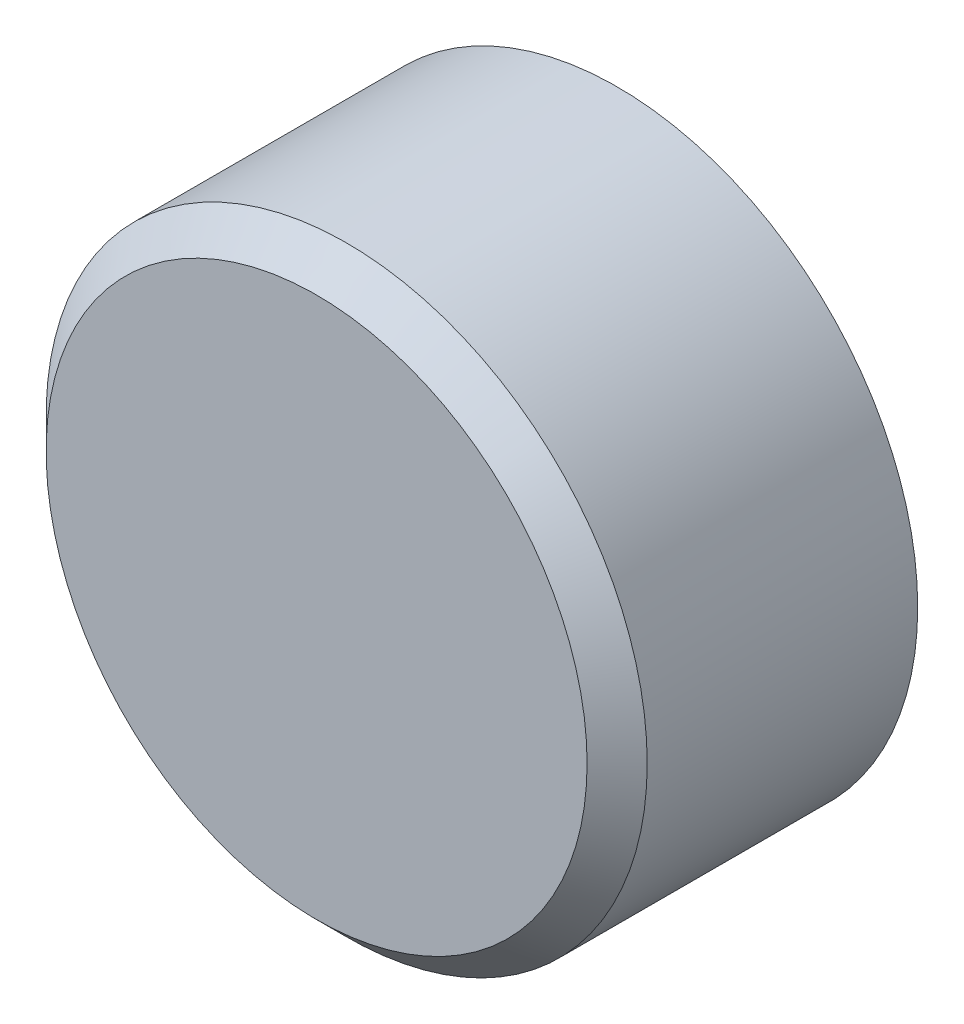
ISO-10303-21;
HEADER;
FILE_DESCRIPTION(('STEP AP214'),'2;1');
FILE_NAME('part.step','',(''),(''),'','','');
FILE_SCHEMA(('AUTOMOTIVE_DESIGN { 1 0 10303 214 1 1 1 1 }'));
ENDSEC;
DATA;
#1=APPLICATION_CONTEXT('core data for automotive mechanical design processes');
#2=APPLICATION_PROTOCOL_DEFINITION('international standard','automotive_design',2000,#1);
#3=PRODUCT_CONTEXT('',#1,'mechanical');
#4=PRODUCT('Part','Part','',(#3));
#5=PRODUCT_RELATED_PRODUCT_CATEGORY('part','',(#4));
#6=PRODUCT_DEFINITION_FORMATION('','',#4);
#7=PRODUCT_DEFINITION_CONTEXT('part definition',#1,'design');
#8=PRODUCT_DEFINITION('design','',#6,#7);
#9=PRODUCT_DEFINITION_SHAPE('','',#8);
#10=(LENGTH_UNIT() NAMED_UNIT(*) SI_UNIT(.MILLI.,.METRE.));
#11=(NAMED_UNIT(*) PLANE_ANGLE_UNIT() SI_UNIT($,.RADIAN.));
#12=(NAMED_UNIT(*) SI_UNIT($,.STERADIAN.) SOLID_ANGLE_UNIT());
#13=UNCERTAINTY_MEASURE_WITH_UNIT(LENGTH_MEASURE(1.E-05),#10,'distance_accuracy_value','');
#14=(GEOMETRIC_REPRESENTATION_CONTEXT(3) GLOBAL_UNCERTAINTY_ASSIGNED_CONTEXT((#13)) GLOBAL_UNIT_ASSIGNED_CONTEXT((#10,
#11,#12)) REPRESENTATION_CONTEXT('',''));
#15=CARTESIAN_POINT('',(0.,0.,0.));
#16=DIRECTION('',(0.,0.,1.));
#17=DIRECTION('',(1.,0.,0.));
#18=AXIS2_PLACEMENT_3D('',#15,#16,#17);
#19=CARTESIAN_POINT('',(0.,0.,20.));
#20=DIRECTION('',(0.,0.,-1.));
#21=DIRECTION('',(-1.,0.,0.));
#22=AXIS2_PLACEMENT_3D('',#19,#20,#21);
#23=CYLINDRICAL_SURFACE('',#22,20.);
#24=CARTESIAN_POINT('',(0.,0.,18.));
#25=DIRECTION('',(0.,0.,1.));
#26=DIRECTION('',(1.,0.,0.));
#27=AXIS2_PLACEMENT_3D('',#24,#25,#26);
#28=CIRCLE('',#27,20.);
#29=CARTESIAN_POINT('',(20.,0.,18.));
#30=VERTEX_POINT('',#29);
#31=EDGE_CURVE('E12',#30,#30,#28,.F.);
#32=ORIENTED_EDGE('',*,*,#31,.T.);
#33=EDGE_LOOP('',(#32));
#34=FACE_BOUND('',#33,.T.);
#35=CARTESIAN_POINT('',(0.,0.,0.));
#36=DIRECTION('',(0.,0.,1.));
#37=DIRECTION('',(1.,0.,0.));
#38=AXIS2_PLACEMENT_3D('',#35,#36,#37);
#39=CIRCLE('',#38,20.);
#40=CARTESIAN_POINT('',(20.,0.,0.));
#41=VERTEX_POINT('',#40);
#42=EDGE_CURVE('E53',#41,#41,#39,.T.);
#43=ORIENTED_EDGE('',*,*,#42,.T.);
#44=EDGE_LOOP('',(#43));
#45=FACE_BOUND('',#44,.T.);
#46=ADVANCED_FACE('F42',(#34,#45),#23,.T.);
#47=CARTESIAN_POINT('',(0.,0.,20.));
#48=DIRECTION('',(0.,0.,1.));
#49=DIRECTION('',(1.,0.,0.));
#50=AXIS2_PLACEMENT_3D('',#47,#48,#49);
#51=PLANE('',#50);
#52=CARTESIAN_POINT('',(0.,0.,20.));
#53=DIRECTION('',(0.,0.,1.));
#54=DIRECTION('',(1.,0.,0.));
#55=AXIS2_PLACEMENT_3D('',#52,#53,#54);
#56=CIRCLE('',#55,18.);
#57=CARTESIAN_POINT('',(18.,0.,20.));
#58=VERTEX_POINT('',#57);
#59=EDGE_CURVE('E49',#58,#58,#56,.T.);
#60=ORIENTED_EDGE('',*,*,#59,.T.);
#61=EDGE_LOOP('',(#60));
#62=FACE_BOUND('',#61,.T.);
#63=ADVANCED_FACE('F63',(#62),#51,.T.);
#64=CARTESIAN_POINT('',(0.,0.,0.));
#65=DIRECTION('',(0.,0.,1.));
#66=DIRECTION('',(1.,0.,0.));
#67=AXIS2_PLACEMENT_3D('',#64,#65,#66);
#68=PLANE('',#67);
#69=ORIENTED_EDGE('',*,*,#42,.F.);
#70=EDGE_LOOP('',(#69));
#71=FACE_BOUND('',#70,.T.);
#72=ADVANCED_FACE('F61',(#71),#68,.F.);
#73=CARTESIAN_POINT('',(0.,0.,20.));
#74=DIRECTION('',(0.,0.,-1.));
#75=DIRECTION('',(-1.,0.,0.));
#76=AXIS2_PLACEMENT_3D('',#73,#74,#75);
#77=CONICAL_SURFACE('',#76,18.,0.785398163397447);
#78=ORIENTED_EDGE('',*,*,#31,.F.);
#79=EDGE_LOOP('',(#78));
#80=FACE_BOUND('',#79,.T.);
#81=ORIENTED_EDGE('',*,*,#59,.F.);
#82=EDGE_LOOP('',(#81));
#83=FACE_BOUND('',#82,.T.);
#84=ADVANCED_FACE('F44',(#80,#83),#77,.T.);
#85=CLOSED_SHELL('',(#46,#63,#72,#84));
#86=MANIFOLD_SOLID_BREP('B2',#85);
#87=ADVANCED_BREP_SHAPE_REPRESENTATION('',(#18,#86),#14);
#88=SHAPE_DEFINITION_REPRESENTATION(#9,#87);
ENDSEC;
END-ISO-10303-21;
